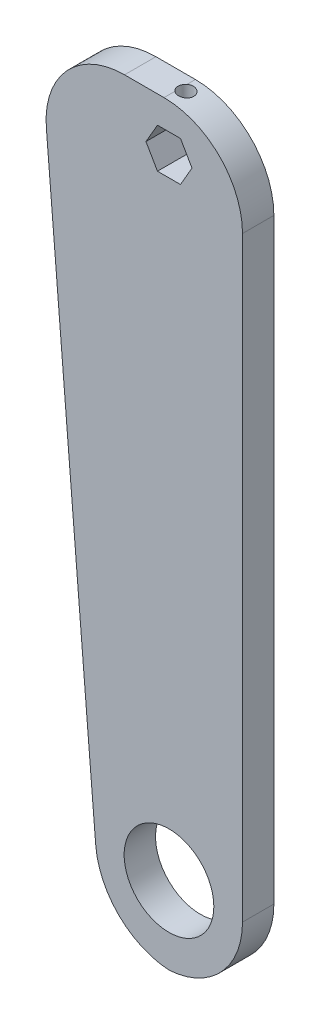
ISO-10303-21;
HEADER;
FILE_DESCRIPTION(('STEP AP214'),'2;1');
FILE_NAME('part.step','',(''),(''),'','','');
FILE_SCHEMA(('AUTOMOTIVE_DESIGN { 1 0 10303 214 1 1 1 1 }'));
ENDSEC;
DATA;
#1=APPLICATION_CONTEXT('core data for automotive mechanical design processes');
#2=APPLICATION_PROTOCOL_DEFINITION('international standard','automotive_design',2000,#1);
#3=PRODUCT_CONTEXT('',#1,'mechanical');
#4=PRODUCT('Part','Part','',(#3));
#5=PRODUCT_RELATED_PRODUCT_CATEGORY('part','',(#4));
#6=PRODUCT_DEFINITION_FORMATION('','',#4);
#7=PRODUCT_DEFINITION_CONTEXT('part definition',#1,'design');
#8=PRODUCT_DEFINITION('design','',#6,#7);
#9=PRODUCT_DEFINITION_SHAPE('','',#8);
#10=(LENGTH_UNIT() NAMED_UNIT(*) SI_UNIT(.MILLI.,.METRE.));
#11=(NAMED_UNIT(*) PLANE_ANGLE_UNIT() SI_UNIT($,.RADIAN.));
#12=(NAMED_UNIT(*) SI_UNIT($,.STERADIAN.) SOLID_ANGLE_UNIT());
#13=UNCERTAINTY_MEASURE_WITH_UNIT(LENGTH_MEASURE(1.E-05),#10,'distance_accuracy_value','');
#14=(GEOMETRIC_REPRESENTATION_CONTEXT(3) GLOBAL_UNCERTAINTY_ASSIGNED_CONTEXT((#13)) GLOBAL_UNIT_ASSIGNED_CONTEXT((#10,
#11,#12)) REPRESENTATION_CONTEXT('',''));
#15=CARTESIAN_POINT('',(0.,0.,0.));
#16=DIRECTION('',(0.,0.,1.));
#17=DIRECTION('',(1.,0.,0.));
#18=AXIS2_PLACEMENT_3D('',#15,#16,#17);
#19=CARTESIAN_POINT('',(-40.,120.,-5.));
#20=DIRECTION('',(0.,0.,1.));
#21=DIRECTION('',(1.,0.,0.));
#22=AXIS2_PLACEMENT_3D('',#19,#20,#21);
#23=PLANE('',#22);
#24=CARTESIAN_POINT('',(0.,-95.26,-5.));
#25=DIRECTION('',(0.,0.,1.));
#26=DIRECTION('',(1.,0.,0.));
#27=AXIS2_PLACEMENT_3D('',#24,#25,#26);
#28=CIRCLE('',#27,14.2875);
#29=CARTESIAN_POINT('',(14.2875,-95.26,-5.));
#30=VERTEX_POINT('',#29);
#31=EDGE_CURVE('E398',#30,#30,#28,.T.);
#32=ORIENTED_EDGE('',*,*,#31,.T.);
#33=EDGE_LOOP('',(#32));
#34=FACE_BOUND('',#33,.T.);
#35=DIRECTION('',(0.5,-0.866025403784438,0.));
#36=VECTOR('',#35,1.);
#37=CARTESIAN_POINT('',(-21.9944518424145,130.395508075689,-5.));
#38=LINE('',#37,#36);
#39=CARTESIAN_POINT('',(-7.33234841870824,105.,-5.));
#40=VERTEX_POINT('',#39);
#41=CARTESIAN_POINT('',(-3.66617420935414,98.65,-5.));
#42=VERTEX_POINT('',#41);
#43=EDGE_CURVE('E430',#40,#42,#38,.T.);
#44=ORIENTED_EDGE('',*,*,#43,.T.);
#45=DIRECTION('',(1.,0.,0.));
#46=VECTOR('',#45,1.);
#47=CARTESIAN_POINT('',(-40.0000000000001,98.6500000000001,-5.));
#48=LINE('',#47,#46);
#49=CARTESIAN_POINT('',(3.6661742093541,98.65,-5.));
#50=VERTEX_POINT('',#49);
#51=EDGE_CURVE('E197',#42,#50,#48,.T.);
#52=ORIENTED_EDGE('',*,*,#51,.T.);
#53=DIRECTION('',(0.5,0.866025403784439,0.));
#54=VECTOR('',#53,1.);
#55=CARTESIAN_POINT('',(1.99445184241445,95.7544919243113,-5.));
#56=LINE('',#55,#54);
#57=CARTESIAN_POINT('',(7.33234841870819,105.,-5.));
#58=VERTEX_POINT('',#57);
#59=EDGE_CURVE('E382',#50,#58,#56,.T.);
#60=ORIENTED_EDGE('',*,*,#59,.T.);
#61=DIRECTION('',(-0.5,0.866025403784439,0.));
#62=VECTOR('',#61,1.);
#63=CARTESIAN_POINT('',(-10.9959292143521,136.745508075689,-5.));
#64=LINE('',#63,#62);
#65=CARTESIAN_POINT('',(3.6661742093541,111.35,-5.));
#66=VERTEX_POINT('',#65);
#67=EDGE_CURVE('E421',#58,#66,#64,.T.);
#68=ORIENTED_EDGE('',*,*,#67,.T.);
#69=DIRECTION('',(-1.,0.,0.));
#70=VECTOR('',#69,1.);
#71=CARTESIAN_POINT('',(-40.,111.35,-5.));
#72=LINE('',#71,#70);
#73=CARTESIAN_POINT('',(-3.66617420935412,111.35,-5.));
#74=VERTEX_POINT('',#73);
#75=EDGE_CURVE('E424',#66,#74,#72,.T.);
#76=ORIENTED_EDGE('',*,*,#75,.T.);
#77=DIRECTION('',(-0.5,-0.866025403784439,0.));
#78=VECTOR('',#77,1.);
#79=CARTESIAN_POINT('',(-9.0040707856479,102.104491924311,-5.));
#80=LINE('',#79,#78);
#81=EDGE_CURVE('E427',#74,#40,#80,.T.);
#82=ORIENTED_EDGE('',*,*,#81,.T.);
#83=EDGE_LOOP('',(#44,#52,#60,#68,#76,#82));
#84=FACE_BOUND('',#83,.T.);
#85=DIRECTION('',(-1.,0.,0.));
#86=VECTOR('',#85,1.);
#87=CARTESIAN_POINT('',(-40.,120.,-5.));
#88=LINE('',#87,#86);
#89=CARTESIAN_POINT('',(-1.58,120.,-5.));
#90=VERTEX_POINT('',#89);
#91=CARTESIAN_POINT('',(-14.1603403930587,120.,-5.));
#92=VERTEX_POINT('',#91);
#93=EDGE_CURVE('E193',#90,#92,#88,.T.);
#94=ORIENTED_EDGE('',*,*,#93,.F.);
#95=CARTESIAN_POINT('',(-1.58,95.,-5.));
#96=DIRECTION('',(0.,0.,1.));
#97=DIRECTION('',(1.,0.,0.));
#98=AXIS2_PLACEMENT_3D('',#95,#96,#97);
#99=CIRCLE('',#98,25.);
#100=CARTESIAN_POINT('',(23.42,95.,-5.));
#101=VERTEX_POINT('',#100);
#102=EDGE_CURVE('E151',#90,#101,#99,.F.);
#103=ORIENTED_EDGE('',*,*,#102,.T.);
#104=DIRECTION('',(0.,1.,0.));
#105=VECTOR('',#104,1.);
#106=CARTESIAN_POINT('',(23.42,-120.,-5.));
#107=LINE('',#106,#105);
#108=CARTESIAN_POINT('',(23.42,-95.,-5.));
#109=VERTEX_POINT('',#108);
#110=EDGE_CURVE('E438',#109,#101,#107,.T.);
#111=ORIENTED_EDGE('',*,*,#110,.F.);
#112=CARTESIAN_POINT('',(-1.58,-95.,-5.));
#113=DIRECTION('',(0.,0.,1.));
#114=DIRECTION('',(1.,0.,0.));
#115=AXIS2_PLACEMENT_3D('',#112,#113,#114);
#116=CIRCLE('',#115,25.);
#117=CARTESIAN_POINT('',(-0.00570470226108136,-119.950382648679,-5.));
#118=VERTEX_POINT('',#117);
#119=EDGE_CURVE('E205',#109,#118,#116,.F.);
#120=ORIENTED_EDGE('',*,*,#119,.T.);
#121=CARTESIAN_POINT('',(1.56859059547783,-95.,-5.));
#122=DIRECTION('',(0.,0.,1.));
#123=DIRECTION('',(1.,0.,0.));
#124=AXIS2_PLACEMENT_3D('',#121,#122,#123);
#125=CIRCLE('',#124,25.);
#126=CARTESIAN_POINT('',(-23.346182642834,-97.062540783476,-5.));
#127=VERTEX_POINT('',#126);
#128=EDGE_CURVE('E203',#118,#127,#125,.F.);
#129=ORIENTED_EDGE('',*,*,#128,.T.);
#130=DIRECTION('',(0.0825016313390409,-0.996590929532472,0.));
#131=VECTOR('',#130,1.);
#132=CARTESIAN_POINT('',(-40.,104.109763943887,-5.));
#133=LINE('',#132,#131);
#134=CARTESIAN_POINT('',(-39.0751136313705,92.937459216524,-5.));
#135=VERTEX_POINT('',#134);
#136=EDGE_CURVE('E168',#135,#127,#133,.T.);
#137=ORIENTED_EDGE('',*,*,#136,.F.);
#138=CARTESIAN_POINT('',(-14.1603403930587,95.,-5.));
#139=DIRECTION('',(0.,0.,1.));
#140=DIRECTION('',(1.,0.,0.));
#141=AXIS2_PLACEMENT_3D('',#138,#139,#140);
#142=CIRCLE('',#141,25.);
#143=EDGE_CURVE('E183',#135,#92,#142,.F.);
#144=ORIENTED_EDGE('',*,*,#143,.T.);
#145=EDGE_LOOP('',(#94,#103,#111,#120,#129,#137,#144));
#146=FACE_BOUND('',#145,.T.);
#147=ADVANCED_FACE('F33',(#34,#84,#146),#23,.F.);
#148=CARTESIAN_POINT('',(-40.,120.,5.));
#149=DIRECTION('',(0.,0.,-1.));
#150=DIRECTION('',(-1.,0.,0.));
#151=AXIS2_PLACEMENT_3D('',#148,#149,#150);
#152=PLANE('',#151);
#153=CARTESIAN_POINT('',(0.,-95.26,5.));
#154=DIRECTION('',(0.,0.,1.));
#155=DIRECTION('',(1.,0.,0.));
#156=AXIS2_PLACEMENT_3D('',#153,#154,#155);
#157=CIRCLE('',#156,14.2875);
#158=CARTESIAN_POINT('',(14.2875,-95.26,5.));
#159=VERTEX_POINT('',#158);
#160=EDGE_CURVE('E175',#159,#159,#157,.T.);
#161=ORIENTED_EDGE('',*,*,#160,.F.);
#162=EDGE_LOOP('',(#161));
#163=FACE_BOUND('',#162,.T.);
#164=DIRECTION('',(0.499999999999999,0.866025403784439,0.));
#165=VECTOR('',#164,1.);
#166=CARTESIAN_POINT('',(3.6661742093541,98.65,5.));
#167=LINE('',#166,#165);
#168=CARTESIAN_POINT('',(3.66617420935409,98.65,5.));
#169=VERTEX_POINT('',#168);
#170=CARTESIAN_POINT('',(7.33234841870821,105.,5.));
#171=VERTEX_POINT('',#170);
#172=EDGE_CURVE('E397',#169,#171,#167,.T.);
#173=ORIENTED_EDGE('',*,*,#172,.F.);
#174=DIRECTION('',(1.,0.,0.));
#175=VECTOR('',#174,1.);
#176=CARTESIAN_POINT('',(-3.66617420935414,98.65,5.));
#177=LINE('',#176,#175);
#178=CARTESIAN_POINT('',(-3.66617420935414,98.65,5.));
#179=VERTEX_POINT('',#178);
#180=EDGE_CURVE('E378',#179,#169,#177,.T.);
#181=ORIENTED_EDGE('',*,*,#180,.F.);
#182=DIRECTION('',(0.5,-0.866025403784438,0.));
#183=VECTOR('',#182,1.);
#184=CARTESIAN_POINT('',(-7.33234841870824,105.,5.));
#185=LINE('',#184,#183);
#186=CARTESIAN_POINT('',(-7.33234841870824,105.,5.));
#187=VERTEX_POINT('',#186);
#188=EDGE_CURVE('E386',#187,#179,#185,.T.);
#189=ORIENTED_EDGE('',*,*,#188,.F.);
#190=DIRECTION('',(-0.5,-0.866025403784438,0.));
#191=VECTOR('',#190,1.);
#192=CARTESIAN_POINT('',(-3.66617420935412,111.35,5.));
#193=LINE('',#192,#191);
#194=CARTESIAN_POINT('',(-3.66617420935412,111.35,5.));
#195=VERTEX_POINT('',#194);
#196=EDGE_CURVE('E392',#195,#187,#193,.T.);
#197=ORIENTED_EDGE('',*,*,#196,.F.);
#198=DIRECTION('',(-1.,0.,0.));
#199=VECTOR('',#198,1.);
#200=CARTESIAN_POINT('',(3.6661742093541,111.35,5.));
#201=LINE('',#200,#199);
#202=CARTESIAN_POINT('',(3.6661742093541,111.35,5.));
#203=VERTEX_POINT('',#202);
#204=EDGE_CURVE('E407',#203,#195,#201,.T.);
#205=ORIENTED_EDGE('',*,*,#204,.F.);
#206=DIRECTION('',(-0.5,0.866025403784438,0.));
#207=VECTOR('',#206,1.);
#208=CARTESIAN_POINT('',(7.33234841870821,105.,5.));
#209=LINE('',#208,#207);
#210=EDGE_CURVE('E400',#171,#203,#209,.T.);
#211=ORIENTED_EDGE('',*,*,#210,.F.);
#212=EDGE_LOOP('',(#173,#181,#189,#197,#205,#211));
#213=FACE_BOUND('',#212,.T.);
#214=DIRECTION('',(0.,1.,0.));
#215=VECTOR('',#214,1.);
#216=CARTESIAN_POINT('',(23.42,-120.,5.));
#217=LINE('',#216,#215);
#218=CARTESIAN_POINT('',(23.42,-95.,5.));
#219=VERTEX_POINT('',#218);
#220=CARTESIAN_POINT('',(23.42,95.,5.));
#221=VERTEX_POINT('',#220);
#222=EDGE_CURVE('E190',#219,#221,#217,.T.);
#223=ORIENTED_EDGE('',*,*,#222,.T.);
#224=CARTESIAN_POINT('',(-1.58,95.,5.));
#225=DIRECTION('',(0.,0.,-1.));
#226=DIRECTION('',(-1.,0.,0.));
#227=AXIS2_PLACEMENT_3D('',#224,#225,#226);
#228=CIRCLE('',#227,25.);
#229=CARTESIAN_POINT('',(-1.58,120.,5.));
#230=VERTEX_POINT('',#229);
#231=EDGE_CURVE('E156',#221,#230,#228,.F.);
#232=ORIENTED_EDGE('',*,*,#231,.T.);
#233=DIRECTION('',(1.,0.,0.));
#234=VECTOR('',#233,1.);
#235=CARTESIAN_POINT('',(-40.,120.,5.));
#236=LINE('',#235,#234);
#237=CARTESIAN_POINT('',(-14.1603403930587,120.,5.));
#238=VERTEX_POINT('',#237);
#239=EDGE_CURVE('E188',#238,#230,#236,.T.);
#240=ORIENTED_EDGE('',*,*,#239,.F.);
#241=CARTESIAN_POINT('',(-14.1603403930587,95.,5.));
#242=DIRECTION('',(0.,0.,-1.));
#243=DIRECTION('',(-1.,0.,0.));
#244=AXIS2_PLACEMENT_3D('',#241,#242,#243);
#245=CIRCLE('',#244,25.);
#246=CARTESIAN_POINT('',(-39.0751136313705,92.937459216524,5.));
#247=VERTEX_POINT('',#246);
#248=EDGE_CURVE('E174',#238,#247,#245,.F.);
#249=ORIENTED_EDGE('',*,*,#248,.T.);
#250=DIRECTION('',(0.0825016313390409,-0.996590929532472,0.));
#251=VECTOR('',#250,1.);
#252=CARTESIAN_POINT('',(-40.,104.109763943887,5.));
#253=LINE('',#252,#251);
#254=CARTESIAN_POINT('',(-23.346182642834,-97.062540783476,5.));
#255=VERTEX_POINT('',#254);
#256=EDGE_CURVE('E165',#247,#255,#253,.T.);
#257=ORIENTED_EDGE('',*,*,#256,.T.);
#258=CARTESIAN_POINT('',(1.56859059547783,-95.,5.));
#259=DIRECTION('',(0.,0.,-1.));
#260=DIRECTION('',(-1.,0.,0.));
#261=AXIS2_PLACEMENT_3D('',#258,#259,#260);
#262=CIRCLE('',#261,25.);
#263=CARTESIAN_POINT('',(-0.00570470226108136,-119.950382648679,5.));
#264=VERTEX_POINT('',#263);
#265=EDGE_CURVE('E56',#255,#264,#262,.F.);
#266=ORIENTED_EDGE('',*,*,#265,.T.);
#267=CARTESIAN_POINT('',(-1.58,-95.,5.));
#268=DIRECTION('',(0.,0.,-1.));
#269=DIRECTION('',(-1.,0.,0.));
#270=AXIS2_PLACEMENT_3D('',#267,#268,#269);
#271=CIRCLE('',#270,25.);
#272=EDGE_CURVE('E180',#264,#219,#271,.F.);
#273=ORIENTED_EDGE('',*,*,#272,.T.);
#274=EDGE_LOOP('',(#223,#232,#240,#249,#257,#266,#273));
#275=FACE_BOUND('',#274,.T.);
#276=ADVANCED_FACE('F172',(#163,#213,#275),#152,.F.);
#277=CARTESIAN_POINT('',(0.,120.,0.));
#278=DIRECTION('',(0.,-1.,0.));
#279=DIRECTION('',(0.,0.,-1.));
#280=AXIS2_PLACEMENT_3D('',#277,#278,#279);
#281=PLANE('',#280);
#282=DIRECTION('',(0.,0.,-1.));
#283=VECTOR('',#282,1.);
#284=CARTESIAN_POINT('',(-1.58,120.,0.));
#285=LINE('',#284,#283);
#286=CARTESIAN_POINT('',(-1.58,120.,1.56516681569684));
#287=VERTEX_POINT('',#286);
#288=EDGE_CURVE('E147',#230,#287,#285,.T.);
#289=ORIENTED_EDGE('',*,*,#288,.T.);
#290=CARTESIAN_POINT('',(0.,120.,-0.372254150433128));
#291=DIRECTION('',(0.,1.,0.));
#292=DIRECTION('',(0.,0.,1.));
#293=AXIS2_PLACEMENT_3D('',#290,#291,#292);
#294=CIRCLE('',#293,2.5);
#295=CARTESIAN_POINT('',(-1.58,120.,-2.3096751165631));
#296=VERTEX_POINT('',#295);
#297=EDGE_CURVE('E48',#296,#287,#294,.T.);
#298=ORIENTED_EDGE('',*,*,#297,.F.);
#299=EDGE_CURVE('E144',#296,#90,#285,.T.);
#300=ORIENTED_EDGE('',*,*,#299,.T.);
#301=ORIENTED_EDGE('',*,*,#93,.T.);
#302=DIRECTION('',(0.,0.,1.));
#303=VECTOR('',#302,1.);
#304=CARTESIAN_POINT('',(-14.1603403930587,120.,0.));
#305=LINE('',#304,#303);
#306=EDGE_CURVE('E153',#92,#238,#305,.T.);
#307=ORIENTED_EDGE('',*,*,#306,.T.);
#308=ORIENTED_EDGE('',*,*,#239,.T.);
#309=EDGE_LOOP('',(#289,#298,#300,#301,#307,#308));
#310=FACE_BOUND('',#309,.T.);
#311=ADVANCED_FACE('F142',(#310),#281,.F.);
#312=CARTESIAN_POINT('',(-3.66617420935414,98.65,-122.));
#313=DIRECTION('',(0.,-1.,0.));
#314=DIRECTION('',(1.,0.,0.));
#315=AXIS2_PLACEMENT_3D('',#312,#313,#314);
#316=PLANE('',#315);
#317=DIRECTION('',(0.,0.,1.));
#318=VECTOR('',#317,1.);
#319=CARTESIAN_POINT('',(-3.66617420935414,98.65,-122.));
#320=LINE('',#319,#318);
#321=EDGE_CURVE('E374',#42,#179,#320,.T.);
#322=ORIENTED_EDGE('',*,*,#321,.T.);
#323=ORIENTED_EDGE('',*,*,#180,.T.);
#324=DIRECTION('',(0.,0.,1.));
#325=VECTOR('',#324,1.);
#326=CARTESIAN_POINT('',(3.6661742093541,98.65,-122.));
#327=LINE('',#326,#325);
#328=EDGE_CURVE('E391',#50,#169,#327,.T.);
#329=ORIENTED_EDGE('',*,*,#328,.F.);
#330=ORIENTED_EDGE('',*,*,#51,.F.);
#331=EDGE_LOOP('',(#322,#323,#329,#330));
#332=FACE_BOUND('',#331,.T.);
#333=ADVANCED_FACE('F257',(#332),#316,.F.);
#334=CARTESIAN_POINT('',(-7.33234841870824,105.,-122.));
#335=DIRECTION('',(-0.866025403784438,-0.5,0.));
#336=DIRECTION('',(0.5,-0.866025403784438,0.));
#337=AXIS2_PLACEMENT_3D('',#334,#335,#336);
#338=PLANE('',#337);
#339=DIRECTION('',(0.,0.,1.));
#340=VECTOR('',#339,1.);
#341=CARTESIAN_POINT('',(-7.33234841870824,105.,-122.));
#342=LINE('',#341,#340);
#343=EDGE_CURVE('E383',#40,#187,#342,.T.);
#344=ORIENTED_EDGE('',*,*,#343,.T.);
#345=ORIENTED_EDGE('',*,*,#188,.T.);
#346=ORIENTED_EDGE('',*,*,#321,.F.);
#347=ORIENTED_EDGE('',*,*,#43,.F.);
#348=EDGE_LOOP('',(#344,#345,#346,#347));
#349=FACE_BOUND('',#348,.T.);
#350=ADVANCED_FACE('F253',(#349),#338,.F.);
#351=CARTESIAN_POINT('',(-3.66617420935412,111.35,-122.));
#352=DIRECTION('',(-0.866025403784438,0.5,0.));
#353=DIRECTION('',(-0.5,-0.866025403784439,0.));
#354=AXIS2_PLACEMENT_3D('',#351,#352,#353);
#355=PLANE('',#354);
#356=DIRECTION('',(0.,0.,1.));
#357=VECTOR('',#356,1.);
#358=CARTESIAN_POINT('',(-3.66617420935412,111.35,-122.));
#359=LINE('',#358,#357);
#360=EDGE_CURVE('E412',#74,#195,#359,.T.);
#361=ORIENTED_EDGE('',*,*,#360,.T.);
#362=ORIENTED_EDGE('',*,*,#196,.T.);
#363=ORIENTED_EDGE('',*,*,#343,.F.);
#364=ORIENTED_EDGE('',*,*,#81,.F.);
#365=EDGE_LOOP('',(#361,#362,#363,#364));
#366=FACE_BOUND('',#365,.T.);
#367=ADVANCED_FACE('F256',(#366),#355,.F.);
#368=CARTESIAN_POINT('',(3.6661742093541,111.35,-122.));
#369=DIRECTION('',(0.,1.,0.));
#370=DIRECTION('',(0.,0.,1.));
#371=AXIS2_PLACEMENT_3D('',#368,#369,#370);
#372=PLANE('',#371);
#373=CARTESIAN_POINT('',(0.,111.35,-0.372254150433128));
#374=DIRECTION('',(0.,1.,0.));
#375=DIRECTION('',(0.,0.,1.));
#376=AXIS2_PLACEMENT_3D('',#373,#374,#375);
#377=CIRCLE('',#376,2.5);
#378=CARTESIAN_POINT('',(0.,111.35,2.12774584956687));
#379=VERTEX_POINT('',#378);
#380=EDGE_CURVE('E139',#379,#379,#377,.T.);
#381=ORIENTED_EDGE('',*,*,#380,.T.);
#382=EDGE_LOOP('',(#381));
#383=FACE_BOUND('',#382,.T.);
#384=DIRECTION('',(0.,0.,1.));
#385=VECTOR('',#384,1.);
#386=CARTESIAN_POINT('',(3.6661742093541,111.35,-122.));
#387=LINE('',#386,#385);
#388=EDGE_CURVE('E414',#66,#203,#387,.T.);
#389=ORIENTED_EDGE('',*,*,#388,.T.);
#390=ORIENTED_EDGE('',*,*,#204,.T.);
#391=ORIENTED_EDGE('',*,*,#360,.F.);
#392=ORIENTED_EDGE('',*,*,#75,.F.);
#393=EDGE_LOOP('',(#389,#390,#391,#392));
#394=FACE_BOUND('',#393,.T.);
#395=ADVANCED_FACE('F261',(#383,#394),#372,.F.);
#396=CARTESIAN_POINT('',(7.33234841870821,105.,-122.));
#397=DIRECTION('',(0.866025403784438,0.5,0.));
#398=DIRECTION('',(-0.5,0.866025403784439,0.));
#399=AXIS2_PLACEMENT_3D('',#396,#397,#398);
#400=PLANE('',#399);
#401=DIRECTION('',(0.,0.,1.));
#402=VECTOR('',#401,1.);
#403=CARTESIAN_POINT('',(7.33234841870821,105.,-122.));
#404=LINE('',#403,#402);
#405=EDGE_CURVE('E416',#58,#171,#404,.T.);
#406=ORIENTED_EDGE('',*,*,#405,.T.);
#407=ORIENTED_EDGE('',*,*,#210,.T.);
#408=ORIENTED_EDGE('',*,*,#388,.F.);
#409=ORIENTED_EDGE('',*,*,#67,.F.);
#410=EDGE_LOOP('',(#406,#407,#408,#409));
#411=FACE_BOUND('',#410,.T.);
#412=ADVANCED_FACE('F265',(#411),#400,.F.);
#413=CARTESIAN_POINT('',(3.6661742093541,98.65,-122.));
#414=DIRECTION('',(0.866025403784439,-0.5,0.));
#415=DIRECTION('',(0.5,0.866025403784439,0.));
#416=AXIS2_PLACEMENT_3D('',#413,#414,#415);
#417=PLANE('',#416);
#418=ORIENTED_EDGE('',*,*,#328,.T.);
#419=ORIENTED_EDGE('',*,*,#172,.T.);
#420=ORIENTED_EDGE('',*,*,#405,.F.);
#421=ORIENTED_EDGE('',*,*,#59,.F.);
#422=EDGE_LOOP('',(#418,#419,#420,#421));
#423=FACE_BOUND('',#422,.T.);
#424=ADVANCED_FACE('F251',(#423),#417,.F.);
#425=CARTESIAN_POINT('',(0.,-95.26,-122.));
#426=DIRECTION('',(0.,0.,1.));
#427=DIRECTION('',(1.,0.,0.));
#428=AXIS2_PLACEMENT_3D('',#425,#426,#427);
#429=CYLINDRICAL_SURFACE('',#428,14.2875);
#430=ORIENTED_EDGE('',*,*,#160,.T.);
#431=EDGE_LOOP('',(#430));
#432=FACE_BOUND('',#431,.T.);
#433=ORIENTED_EDGE('',*,*,#31,.F.);
#434=EDGE_LOOP('',(#433));
#435=FACE_BOUND('',#434,.T.);
#436=ADVANCED_FACE('F248',(#432,#435),#429,.F.);
#437=CARTESIAN_POINT('',(-40.,104.109763943887,5.));
#438=DIRECTION('',(0.996590929532472,0.0825016313390409,0.));
#439=DIRECTION('',(-0.0825016313390409,0.996590929532472,0.));
#440=AXIS2_PLACEMENT_3D('',#437,#438,#439);
#441=PLANE('',#440);
#442=ORIENTED_EDGE('',*,*,#256,.F.);
#443=DIRECTION('',(0.,0.,1.));
#444=VECTOR('',#443,1.);
#445=CARTESIAN_POINT('',(-39.0751136313705,92.937459216524,5.));
#446=LINE('',#445,#444);
#447=EDGE_CURVE('E11',#247,#135,#446,.F.);
#448=ORIENTED_EDGE('',*,*,#447,.T.);
#449=ORIENTED_EDGE('',*,*,#136,.T.);
#450=DIRECTION('',(0.,0.,-1.));
#451=VECTOR('',#450,1.);
#452=CARTESIAN_POINT('',(-23.346182642834,-97.062540783476,5.));
#453=LINE('',#452,#451);
#454=EDGE_CURVE('E42',#127,#255,#453,.F.);
#455=ORIENTED_EDGE('',*,*,#454,.T.);
#456=EDGE_LOOP('',(#442,#448,#449,#455));
#457=FACE_BOUND('',#456,.T.);
#458=ADVANCED_FACE('F164',(#457),#441,.F.);
#459=CARTESIAN_POINT('',(23.42,-120.,5.));
#460=DIRECTION('',(-1.,0.,0.));
#461=DIRECTION('',(0.,0.,1.));
#462=AXIS2_PLACEMENT_3D('',#459,#460,#461);
#463=PLANE('',#462);
#464=ORIENTED_EDGE('',*,*,#222,.F.);
#465=DIRECTION('',(0.,0.,-1.));
#466=VECTOR('',#465,1.);
#467=CARTESIAN_POINT('',(23.42,-95.,-5.));
#468=LINE('',#467,#466);
#469=EDGE_CURVE('E195',#219,#109,#468,.T.);
#470=ORIENTED_EDGE('',*,*,#469,.T.);
#471=ORIENTED_EDGE('',*,*,#110,.T.);
#472=DIRECTION('',(0.,0.,-1.));
#473=VECTOR('',#472,1.);
#474=CARTESIAN_POINT('',(23.42,95.,5.));
#475=LINE('',#474,#473);
#476=EDGE_CURVE('E192',#101,#221,#475,.F.);
#477=ORIENTED_EDGE('',*,*,#476,.T.);
#478=EDGE_LOOP('',(#464,#470,#471,#477));
#479=FACE_BOUND('',#478,.T.);
#480=ADVANCED_FACE('F233',(#479),#463,.F.);
#481=CARTESIAN_POINT('',(1.56859059547783,-95.,0.));
#482=DIRECTION('',(0.,0.,1.));
#483=DIRECTION('',(1.,0.,0.));
#484=AXIS2_PLACEMENT_3D('',#481,#482,#483);
#485=CYLINDRICAL_SURFACE('',#484,25.);
#486=DIRECTION('',(0.,0.,1.));
#487=VECTOR('',#486,1.);
#488=CARTESIAN_POINT('',(-0.00570470226108179,-119.950382648679,0.));
#489=LINE('',#488,#487);
#490=EDGE_CURVE('E37',#264,#118,#489,.F.);
#491=ORIENTED_EDGE('',*,*,#490,.F.);
#492=ORIENTED_EDGE('',*,*,#265,.F.);
#493=ORIENTED_EDGE('',*,*,#454,.F.);
#494=ORIENTED_EDGE('',*,*,#128,.F.);
#495=EDGE_LOOP('',(#491,#492,#493,#494));
#496=FACE_BOUND('',#495,.T.);
#497=ADVANCED_FACE('F177',(#496),#485,.T.);
#498=CARTESIAN_POINT('',(-1.58,-95.,5.));
#499=DIRECTION('',(0.,0.,1.));
#500=DIRECTION('',(1.,0.,0.));
#501=AXIS2_PLACEMENT_3D('',#498,#499,#500);
#502=CYLINDRICAL_SURFACE('',#501,25.);
#503=ORIENTED_EDGE('',*,*,#272,.F.);
#504=ORIENTED_EDGE('',*,*,#490,.T.);
#505=ORIENTED_EDGE('',*,*,#119,.F.);
#506=ORIENTED_EDGE('',*,*,#469,.F.);
#507=EDGE_LOOP('',(#503,#504,#505,#506));
#508=FACE_BOUND('',#507,.T.);
#509=ADVANCED_FACE('F216',(#508),#502,.T.);
#510=CARTESIAN_POINT('',(-1.58,95.,0.));
#511=DIRECTION('',(0.,0.,-1.));
#512=DIRECTION('',(-1.,0.,0.));
#513=AXIS2_PLACEMENT_3D('',#510,#511,#512);
#514=CYLINDRICAL_SURFACE('',#513,25.);
#515=CARTESIAN_POINT('',(-1.58,120.,1.56516681569684));
#516=CARTESIAN_POINT('',(-1.52569228620901,120.000001226178,1.60946449546942));
#517=CARTESIAN_POINT('',(-1.46951564466554,119.999823089751,1.65146603904704));
#518=CARTESIAN_POINT('',(-1.35384066715285,119.999043607725,1.73060525306203));
#519=CARTESIAN_POINT('',(-1.29434245566265,119.998442277976,1.76774310559658));
#520=CARTESIAN_POINT('',(-1.17248151448894,119.996752561073,1.83686108957874));
#521=CARTESIAN_POINT('',(-1.11012093905129,119.995664534989,1.86884502072345));
#522=CARTESIAN_POINT('',(-0.982965860196317,119.9929511312,1.92746022342451));
#523=CARTESIAN_POINT('',(-0.918171396445835,119.991325762249,1.95409158217074));
#524=CARTESIAN_POINT('',(-0.720740214986053,119.985574234829,2.02568035211162));
#525=CARTESIAN_POINT('',(-0.585011526317958,119.980572119621,2.06235745990383));
#526=CARTESIAN_POINT('',(-0.309547540493851,119.968079287423,2.11245980928036));
#527=CARTESIAN_POINT('',(-0.169813116088536,119.960589108811,2.12589007721919));
#528=CARTESIAN_POINT('',(0.10978970358798,119.943219815559,2.12924132819473));
#529=CARTESIAN_POINT('',(0.249658083446603,119.933340948984,2.11916475147207));
#530=CARTESIAN_POINT('',(0.525617644508418,119.911554526392,2.0758560293497));
#531=CARTESIAN_POINT('',(0.661708076533723,119.899646571297,2.04261932485917));
#532=CARTESIAN_POINT('',(0.92705657473869,119.874334934512,1.95374017001153));
#533=CARTESIAN_POINT('',(1.05627296037969,119.860923388871,1.89797553106189));
#534=CARTESIAN_POINT('',(1.30348771636392,119.833465047624,1.765637031711));
#535=CARTESIAN_POINT('',(1.42148627026372,119.819418262417,1.68906351188308));
#536=CARTESIAN_POINT('',(1.64376788401057,119.791530242392,1.51664562858027));
#537=CARTESIAN_POINT('',(1.74795379604074,119.777691014215,1.42067563906561));
#538=CARTESIAN_POINT('',(1.93873199121862,119.751319613331,1.21244065525398));
#539=CARTESIAN_POINT('',(2.02532389492089,119.738787468816,1.10017530960876));
#540=CARTESIAN_POINT('',(2.17827820944014,119.716013754036,0.862663689927644));
#541=CARTESIAN_POINT('',(2.24467327480193,119.705768493521,0.737438813225759));
#542=CARTESIAN_POINT('',(2.3554315909966,119.688368532044,0.477398497141097));
#543=CARTESIAN_POINT('',(2.39979658721155,119.68121358625,0.342583818499907));
#544=CARTESIAN_POINT('',(2.46476842172612,119.670649157974,0.0687667190377598));
#545=CARTESIAN_POINT('',(2.48562999146791,119.667199536457,-0.0701737130075668));
#546=CARTESIAN_POINT('',(2.50381522740925,119.664195565148,-0.349624858831428));
#547=CARTESIAN_POINT('',(2.50114027432178,119.664640986862,-0.490135480015681));
#548=CARTESIAN_POINT('',(2.47246684163958,119.669367926252,-0.767435900661265));
#549=CARTESIAN_POINT('',(2.44667318758911,119.673615755185,-0.904247528544433));
#550=CARTESIAN_POINT('',(2.37283170078187,119.685552610668,-1.17156563260407));
#551=CARTESIAN_POINT('',(2.32478353432348,119.693241688819,-1.30207201420232));
#552=CARTESIAN_POINT('',(2.20764357441484,119.711480404204,-1.55362191545486));
#553=CARTESIAN_POINT('',(2.13847681357404,119.722040217172,-1.67462976134749));
#554=CARTESIAN_POINT('',(1.98114710938954,119.745192124585,-1.90337438984282));
#555=CARTESIAN_POINT('',(1.89298282244009,119.757784362759,-2.01111023293163));
#556=CARTESIAN_POINT('',(1.69897809487519,119.784228359044,-2.21159003624315));
#557=CARTESIAN_POINT('',(1.59294305676972,119.798093120845,-2.30414400576449));
#558=CARTESIAN_POINT('',(1.36688179748503,119.825971039172,-2.47018275655721));
#559=CARTESIAN_POINT('',(1.2468549718291,119.839984202085,-2.54366671351833));
#560=CARTESIAN_POINT('',(0.995246676389494,119.86733214327,-2.66995571759179));
#561=CARTESIAN_POINT('',(0.863591183300068,119.880661572574,-2.72261455812028));
#562=CARTESIAN_POINT('',(0.593145508582957,119.905739606092,-2.80498042508371));
#563=CARTESIAN_POINT('',(0.454355684624406,119.917488289447,-2.83468860092175));
#564=CARTESIAN_POINT('',(0.174104118539771,119.938780851149,-2.87016631480292));
#565=CARTESIAN_POINT('',(0.0326540960058524,119.948332688309,-2.87602359214413));
#566=CARTESIAN_POINT('',(-0.249390227106235,119.964964115218,-2.86378504480192));
#567=CARTESIAN_POINT('',(-0.389984360873807,119.9720432373,-2.8456846920771));
#568=CARTESIAN_POINT('',(-0.665250374871351,119.9836367573,-2.78620331109023));
#569=CARTESIAN_POINT('',(-0.799955734638251,119.988168089472,-2.74497972722984));
#570=CARTESIAN_POINT('',(-1.06050235041148,119.994940966511,-2.64050862337311));
#571=CARTESIAN_POINT('',(-1.18635430027653,119.997185319574,-2.57728824171968));
#572=CARTESIAN_POINT('',(-1.35374974943818,119.999022491693,-2.47475895428044));
#573=CARTESIAN_POINT('',(-1.4005916954507,119.999398276401,-2.44384686135647));
#574=CARTESIAN_POINT('',(-1.49200900166689,119.999886695183,-2.37900194072557));
#575=CARTESIAN_POINT('',(-1.53658834035379,119.999999808002,-2.34507472579143));
#576=CARTESIAN_POINT('',(-1.58000000000001,120.,-2.30967511656311));
#577=B_SPLINE_CURVE_WITH_KNOTS('',3,(#515,#516,#517,#518,#519,#520,#521,#522,#523,#524,#525,
#526,#527,#528,#529,#530,#531,#532,#533,#534,#535,#536,#537,#538,#539,#540,#541,#542,#543,#544,
#545,#546,#547,#548,#549,#550,#551,#552,#553,#554,#555,#556,#557,#558,#559,#560,#561,#562,#563,
#564,#565,#566,#567,#568,#569,#570,#571,#572,#573,#574,#575,#576),.UNSPECIFIED.,.F.,.F.,(4,2,2,
2,2,2,2,2,2,2,2,2,2,2,2,2,2,2,2,2,2,2,2,2,2,2,2,2,2,2,4),(0.,0.210181059779737,
0.420354248104032,0.630371771515896,0.840385873602966,1.26026369627056,1.6800507230044,
2.09979417367409,2.51962027454873,2.94175470277686,3.36388222246077,3.78883681129703,
4.21380056404681,4.63807353179123,5.06231288018466,5.48190868649189,5.90147987839372,
6.3173701297338,6.73326661746078,7.15065697768632,7.56807686766564,7.99037670201038,
8.41269478742473,8.83792732579921,9.26313856652096,9.68678417961328,10.1105098740334,
10.5313848737172,10.9517424532999,11.1200120685777,11.2879747542367),.UNSPECIFIED.);
#578=EDGE_CURVE('E132',#287,#296,#577,.T.);
#579=ORIENTED_EDGE('',*,*,#578,.F.);
#580=ORIENTED_EDGE('',*,*,#288,.F.);
#581=ORIENTED_EDGE('',*,*,#231,.F.);
#582=ORIENTED_EDGE('',*,*,#476,.F.);
#583=ORIENTED_EDGE('',*,*,#102,.F.);
#584=ORIENTED_EDGE('',*,*,#299,.F.);
#585=EDGE_LOOP('',(#579,#580,#581,#582,#583,#584));
#586=FACE_BOUND('',#585,.T.);
#587=ADVANCED_FACE('F149',(#586),#514,.T.);
#588=CARTESIAN_POINT('',(-14.1603403930587,95.,0.));
#589=DIRECTION('',(0.,0.,1.));
#590=DIRECTION('',(1.,0.,0.));
#591=AXIS2_PLACEMENT_3D('',#588,#589,#590);
#592=CYLINDRICAL_SURFACE('',#591,25.);
#593=ORIENTED_EDGE('',*,*,#143,.F.);
#594=ORIENTED_EDGE('',*,*,#447,.F.);
#595=ORIENTED_EDGE('',*,*,#248,.F.);
#596=ORIENTED_EDGE('',*,*,#306,.F.);
#597=EDGE_LOOP('',(#593,#594,#595,#596));
#598=FACE_BOUND('',#597,.T.);
#599=ADVANCED_FACE('F35',(#598),#592,.T.);
#600=CARTESIAN_POINT('',(0.,120.,-0.372254150433128));
#601=DIRECTION('',(0.,1.,0.));
#602=DIRECTION('',(0.,0.,1.));
#603=AXIS2_PLACEMENT_3D('',#600,#601,#602);
#604=CYLINDRICAL_SURFACE('',#603,2.5);
#605=ORIENTED_EDGE('',*,*,#578,.T.);
#606=ORIENTED_EDGE('',*,*,#297,.T.);
#607=EDGE_LOOP('',(#605,#606));
#608=FACE_BOUND('',#607,.T.);
#609=ORIENTED_EDGE('',*,*,#380,.F.);
#610=EDGE_LOOP('',(#609));
#611=FACE_BOUND('',#610,.T.);
#612=ADVANCED_FACE('F133',(#608,#611),#604,.F.);
#613=CLOSED_SHELL('',(#147,#276,#311,#333,#350,#367,#395,#412,#424,#436,#458,#480,#497,#509,
#587,#599,#612));
#614=MANIFOLD_SOLID_BREP('B2',#613);
#615=ADVANCED_BREP_SHAPE_REPRESENTATION('',(#18,#614),#14);
#616=SHAPE_DEFINITION_REPRESENTATION(#9,#615);
ENDSEC;
END-ISO-10303-21;
